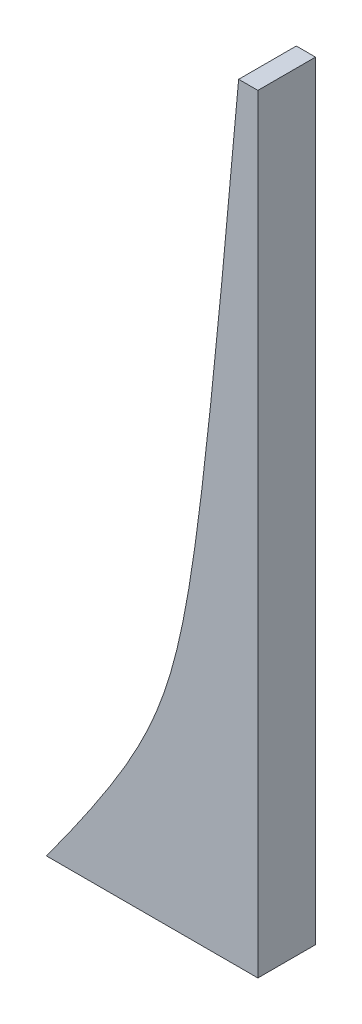
ISO-10303-21;
HEADER;
FILE_DESCRIPTION(('STEP AP214'),'2;1');
FILE_NAME('part.step','',(''),(''),'','','');
FILE_SCHEMA(('AUTOMOTIVE_DESIGN { 1 0 10303 214 1 1 1 1 }'));
ENDSEC;
DATA;
#1=APPLICATION_CONTEXT('core data for automotive mechanical design processes');
#2=APPLICATION_PROTOCOL_DEFINITION('international standard','automotive_design',2000,#1);
#3=PRODUCT_CONTEXT('',#1,'mechanical');
#4=PRODUCT('Part','Part','',(#3));
#5=PRODUCT_RELATED_PRODUCT_CATEGORY('part','',(#4));
#6=PRODUCT_DEFINITION_FORMATION('','',#4);
#7=PRODUCT_DEFINITION_CONTEXT('part definition',#1,'design');
#8=PRODUCT_DEFINITION('design','',#6,#7);
#9=PRODUCT_DEFINITION_SHAPE('','',#8);
#10=(LENGTH_UNIT() NAMED_UNIT(*) SI_UNIT(.MILLI.,.METRE.));
#11=(NAMED_UNIT(*) PLANE_ANGLE_UNIT() SI_UNIT($,.RADIAN.));
#12=(NAMED_UNIT(*) SI_UNIT($,.STERADIAN.) SOLID_ANGLE_UNIT());
#13=UNCERTAINTY_MEASURE_WITH_UNIT(LENGTH_MEASURE(1.E-05),#10,'distance_accuracy_value','');
#14=(GEOMETRIC_REPRESENTATION_CONTEXT(3) GLOBAL_UNCERTAINTY_ASSIGNED_CONTEXT((#13)) GLOBAL_UNIT_ASSIGNED_CONTEXT((#10,
#11,#12)) REPRESENTATION_CONTEXT('',''));
#15=CARTESIAN_POINT('',(0.,0.,0.));
#16=DIRECTION('',(0.,0.,1.));
#17=DIRECTION('',(1.,0.,0.));
#18=AXIS2_PLACEMENT_3D('',#15,#16,#17);
#19=CARTESIAN_POINT('',(9.99999999999999,40.,3.));
#20=CARTESIAN_POINT('',(7.33985808925216,10.0963844627478,3.));
#21=CARTESIAN_POINT('',(0.,0.,3.));
#22=(BOUNDED_CURVE() B_SPLINE_CURVE(2,(#19,#20,#21),.UNSPECIFIED.,.F.,
.F.) B_SPLINE_CURVE_WITH_KNOTS((3,3),(0.,1.),
.UNSPECIFIED.) CURVE() GEOMETRIC_REPRESENTATION_ITEM() RATIONAL_B_SPLINE_CURVE((1.,3.,1.)) REPRESENTATION_ITEM(''));
#23=DIRECTION('',(0.,0.,-1.));
#24=VECTOR('',#23,1.);
#25=SURFACE_OF_LINEAR_EXTRUSION('',#22,#24);
#26=CARTESIAN_POINT('',(9.99999999999999,40.,0.));
#27=CARTESIAN_POINT('',(7.33985808925216,10.0963844627478,0.));
#28=CARTESIAN_POINT('',(0.,0.,0.));
#29=(BOUNDED_CURVE() B_SPLINE_CURVE(2,(#26,#27,#28),.UNSPECIFIED.,.F.,
.F.) B_SPLINE_CURVE_WITH_KNOTS((3,3),(0.,1.),
.UNSPECIFIED.) CURVE() GEOMETRIC_REPRESENTATION_ITEM() RATIONAL_B_SPLINE_CURVE((1.,3.,1.)) REPRESENTATION_ITEM(''));
#30=CARTESIAN_POINT('',(9.99999999999999,40.,0.));
#31=VERTEX_POINT('',#30);
#32=CARTESIAN_POINT('',(0.,0.,0.));
#33=VERTEX_POINT('',#32);
#34=EDGE_CURVE('E97',#31,#33,#29,.T.);
#35=ORIENTED_EDGE('',*,*,#34,.T.);
#36=DIRECTION('',(0.,0.,-1.));
#37=VECTOR('',#36,1.);
#38=CARTESIAN_POINT('',(0.,0.,3.));
#39=LINE('',#38,#37);
#40=CARTESIAN_POINT('',(0.,0.,3.));
#41=VERTEX_POINT('',#40);
#42=EDGE_CURVE('E11',#41,#33,#39,.T.);
#43=ORIENTED_EDGE('',*,*,#42,.F.);
#44=CARTESIAN_POINT('',(9.99999999999999,40.,3.));
#45=VERTEX_POINT('',#44);
#46=EDGE_CURVE('E84',#45,#41,#22,.T.);
#47=ORIENTED_EDGE('',*,*,#46,.F.);
#48=DIRECTION('',(0.,0.,-1.));
#49=VECTOR('',#48,1.);
#50=CARTESIAN_POINT('',(9.99999999999999,40.,3.));
#51=LINE('',#50,#49);
#52=EDGE_CURVE('E51',#45,#31,#51,.T.);
#53=ORIENTED_EDGE('',*,*,#52,.T.);
#54=EDGE_LOOP('',(#35,#43,#47,#53));
#55=FACE_BOUND('',#54,.T.);
#56=ADVANCED_FACE('F34',(#55),#25,.F.);
#57=CARTESIAN_POINT('',(0.,0.,3.));
#58=DIRECTION('',(0.,1.,0.));
#59=DIRECTION('',(0.,0.,1.));
#60=AXIS2_PLACEMENT_3D('',#57,#58,#59);
#61=PLANE('',#60);
#62=DIRECTION('',(1.,0.,0.));
#63=VECTOR('',#62,1.);
#64=CARTESIAN_POINT('',(0.,0.,0.));
#65=LINE('',#64,#63);
#66=CARTESIAN_POINT('',(11.,0.,0.));
#67=VERTEX_POINT('',#66);
#68=EDGE_CURVE('E89',#33,#67,#65,.T.);
#69=ORIENTED_EDGE('',*,*,#68,.T.);
#70=DIRECTION('',(0.,0.,-1.));
#71=VECTOR('',#70,1.);
#72=CARTESIAN_POINT('',(11.,0.,3.));
#73=LINE('',#72,#71);
#74=CARTESIAN_POINT('',(11.,0.,3.));
#75=VERTEX_POINT('',#74);
#76=EDGE_CURVE('E43',#75,#67,#73,.T.);
#77=ORIENTED_EDGE('',*,*,#76,.F.);
#78=DIRECTION('',(1.,0.,0.));
#79=VECTOR('',#78,1.);
#80=CARTESIAN_POINT('',(0.,0.,3.));
#81=LINE('',#80,#79);
#82=EDGE_CURVE('E77',#41,#75,#81,.T.);
#83=ORIENTED_EDGE('',*,*,#82,.F.);
#84=ORIENTED_EDGE('',*,*,#42,.T.);
#85=EDGE_LOOP('',(#69,#77,#83,#84));
#86=FACE_BOUND('',#85,.T.);
#87=ADVANCED_FACE('F88',(#86),#61,.F.);
#88=CARTESIAN_POINT('',(11.,0.,3.));
#89=DIRECTION('',(-1.,0.,0.));
#90=DIRECTION('',(0.,-1.,0.));
#91=AXIS2_PLACEMENT_3D('',#88,#89,#90);
#92=PLANE('',#91);
#93=DIRECTION('',(0.,1.,0.));
#94=VECTOR('',#93,1.);
#95=CARTESIAN_POINT('',(11.,0.,0.));
#96=LINE('',#95,#94);
#97=CARTESIAN_POINT('',(11.,40.,0.));
#98=VERTEX_POINT('',#97);
#99=EDGE_CURVE('E105',#67,#98,#96,.T.);
#100=ORIENTED_EDGE('',*,*,#99,.T.);
#101=DIRECTION('',(0.,0.,-1.));
#102=VECTOR('',#101,1.);
#103=CARTESIAN_POINT('',(11.,40.,3.));
#104=LINE('',#103,#102);
#105=CARTESIAN_POINT('',(11.,40.,3.));
#106=VERTEX_POINT('',#105);
#107=EDGE_CURVE('E66',#106,#98,#104,.T.);
#108=ORIENTED_EDGE('',*,*,#107,.F.);
#109=DIRECTION('',(0.,1.,0.));
#110=VECTOR('',#109,1.);
#111=CARTESIAN_POINT('',(11.,0.,3.));
#112=LINE('',#111,#110);
#113=EDGE_CURVE('E83',#75,#106,#112,.T.);
#114=ORIENTED_EDGE('',*,*,#113,.F.);
#115=ORIENTED_EDGE('',*,*,#76,.T.);
#116=EDGE_LOOP('',(#100,#108,#114,#115));
#117=FACE_BOUND('',#116,.T.);
#118=ADVANCED_FACE('F92',(#117),#92,.F.);
#119=CARTESIAN_POINT('',(9.99999999999999,40.,3.));
#120=DIRECTION('',(0.,1.,0.));
#121=DIRECTION('',(0.,0.,1.));
#122=AXIS2_PLACEMENT_3D('',#119,#120,#121);
#123=PLANE('',#122);
#124=DIRECTION('',(1.,0.,0.));
#125=VECTOR('',#124,1.);
#126=CARTESIAN_POINT('',(9.99999999999999,40.,0.));
#127=LINE('',#126,#125);
#128=EDGE_CURVE('E107',#31,#98,#127,.T.);
#129=ORIENTED_EDGE('',*,*,#128,.F.);
#130=ORIENTED_EDGE('',*,*,#52,.F.);
#131=DIRECTION('',(1.,0.,0.));
#132=VECTOR('',#131,1.);
#133=CARTESIAN_POINT('',(9.99999999999999,40.,3.));
#134=LINE('',#133,#132);
#135=EDGE_CURVE('E93',#45,#106,#134,.T.);
#136=ORIENTED_EDGE('',*,*,#135,.T.);
#137=ORIENTED_EDGE('',*,*,#107,.T.);
#138=EDGE_LOOP('',(#129,#130,#136,#137));
#139=FACE_BOUND('',#138,.T.);
#140=ADVANCED_FACE('F119',(#139),#123,.T.);
#141=CARTESIAN_POINT('',(6.75489356693912,12.5722883470609,3.));
#142=DIRECTION('',(0.,0.,1.));
#143=DIRECTION('',(1.,0.,0.));
#144=AXIS2_PLACEMENT_3D('',#141,#142,#143);
#145=PLANE('',#144);
#146=ORIENTED_EDGE('',*,*,#46,.T.);
#147=ORIENTED_EDGE('',*,*,#82,.T.);
#148=ORIENTED_EDGE('',*,*,#113,.T.);
#149=ORIENTED_EDGE('',*,*,#135,.F.);
#150=EDGE_LOOP('',(#146,#147,#148,#149));
#151=FACE_BOUND('',#150,.T.);
#152=ADVANCED_FACE('F80',(#151),#145,.T.);
#153=CARTESIAN_POINT('',(6.75489356693912,12.5722883470609,0.));
#154=DIRECTION('',(0.,0.,1.));
#155=DIRECTION('',(1.,0.,0.));
#156=AXIS2_PLACEMENT_3D('',#153,#154,#155);
#157=PLANE('',#156);
#158=ORIENTED_EDGE('',*,*,#34,.F.);
#159=ORIENTED_EDGE('',*,*,#128,.T.);
#160=ORIENTED_EDGE('',*,*,#99,.F.);
#161=ORIENTED_EDGE('',*,*,#68,.F.);
#162=EDGE_LOOP('',(#158,#159,#160,#161));
#163=FACE_BOUND('',#162,.T.);
#164=ADVANCED_FACE('F118',(#163),#157,.F.);
#165=CLOSED_SHELL('',(#56,#87,#118,#140,#152,#164));
#166=MANIFOLD_SOLID_BREP('B2',#165);
#167=ADVANCED_BREP_SHAPE_REPRESENTATION('',(#18,#166),#14);
#168=SHAPE_DEFINITION_REPRESENTATION(#9,#167);
ENDSEC;
END-ISO-10303-21;
